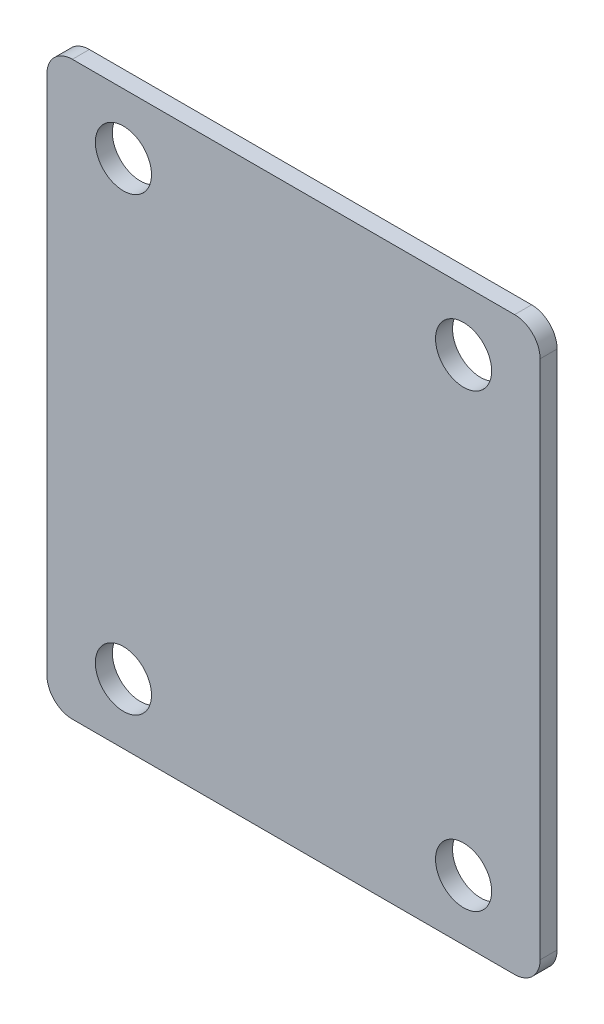
ISO-10303-21;
HEADER;
FILE_DESCRIPTION(('STEP AP214'),'2;1');
FILE_NAME('part.step','',(''),(''),'','','');
FILE_SCHEMA(('AUTOMOTIVE_DESIGN { 1 0 10303 214 1 1 1 1 }'));
ENDSEC;
DATA;
#1=APPLICATION_CONTEXT('core data for automotive mechanical design processes');
#2=APPLICATION_PROTOCOL_DEFINITION('international standard','automotive_design',2000,#1);
#3=PRODUCT_CONTEXT('',#1,'mechanical');
#4=PRODUCT('Part','Part','',(#3));
#5=PRODUCT_RELATED_PRODUCT_CATEGORY('part','',(#4));
#6=PRODUCT_DEFINITION_FORMATION('','',#4);
#7=PRODUCT_DEFINITION_CONTEXT('part definition',#1,'design');
#8=PRODUCT_DEFINITION('design','',#6,#7);
#9=PRODUCT_DEFINITION_SHAPE('','',#8);
#10=(LENGTH_UNIT() NAMED_UNIT(*) SI_UNIT(.MILLI.,.METRE.));
#11=(NAMED_UNIT(*) PLANE_ANGLE_UNIT() SI_UNIT($,.RADIAN.));
#12=(NAMED_UNIT(*) SI_UNIT($,.STERADIAN.) SOLID_ANGLE_UNIT());
#13=UNCERTAINTY_MEASURE_WITH_UNIT(LENGTH_MEASURE(1.E-05),#10,'distance_accuracy_value','');
#14=(GEOMETRIC_REPRESENTATION_CONTEXT(3) GLOBAL_UNCERTAINTY_ASSIGNED_CONTEXT((#13)) GLOBAL_UNIT_ASSIGNED_CONTEXT((#10,
#11,#12)) REPRESENTATION_CONTEXT('',''));
#15=CARTESIAN_POINT('',(0.,0.,0.));
#16=DIRECTION('',(0.,0.,1.));
#17=DIRECTION('',(1.,0.,0.));
#18=AXIS2_PLACEMENT_3D('',#15,#16,#17);
#19=CARTESIAN_POINT('',(0.,0.,2.));
#20=DIRECTION('',(0.,0.,1.));
#21=DIRECTION('',(1.,0.,0.));
#22=AXIS2_PLACEMENT_3D('',#19,#20,#21);
#23=PLANE('',#22);
#24=CARTESIAN_POINT('',(19.9999999999749,-26.5000000000065,2.));
#25=DIRECTION('',(0.,0.,1.));
#26=DIRECTION('',(1.,0.,0.));
#27=AXIS2_PLACEMENT_3D('',#24,#25,#26);
#28=CIRCLE('',#27,3.3);
#29=CARTESIAN_POINT('',(23.2999999999749,-26.5000000000065,2.));
#30=VERTEX_POINT('',#29);
#31=EDGE_CURVE('E155',#30,#30,#28,.T.);
#32=ORIENTED_EDGE('',*,*,#31,.F.);
#33=EDGE_LOOP('',(#32));
#34=FACE_BOUND('',#33,.T.);
#35=CARTESIAN_POINT('',(-20.0000000000251,-26.5000000000064,2.));
#36=DIRECTION('',(0.,0.,1.));
#37=DIRECTION('',(1.,0.,0.));
#38=AXIS2_PLACEMENT_3D('',#35,#36,#37);
#39=CIRCLE('',#38,3.3);
#40=CARTESIAN_POINT('',(-16.7000000000251,-26.5000000000064,2.));
#41=VERTEX_POINT('',#40);
#42=EDGE_CURVE('E170',#41,#41,#39,.T.);
#43=ORIENTED_EDGE('',*,*,#42,.F.);
#44=EDGE_LOOP('',(#43));
#45=FACE_BOUND('',#44,.T.);
#46=CARTESIAN_POINT('',(-20.0000000000249,26.4999999999936,2.));
#47=DIRECTION('',(0.,0.,1.));
#48=DIRECTION('',(1.,0.,0.));
#49=AXIS2_PLACEMENT_3D('',#46,#47,#48);
#50=CIRCLE('',#49,3.3);
#51=CARTESIAN_POINT('',(-16.7000000000249,26.4999999999936,2.));
#52=VERTEX_POINT('',#51);
#53=EDGE_CURVE('E176',#52,#52,#50,.T.);
#54=ORIENTED_EDGE('',*,*,#53,.F.);
#55=EDGE_LOOP('',(#54));
#56=FACE_BOUND('',#55,.T.);
#57=CARTESIAN_POINT('',(19.9999999999751,26.4999999999935,2.));
#58=DIRECTION('',(0.,0.,1.));
#59=DIRECTION('',(1.,0.,0.));
#60=AXIS2_PLACEMENT_3D('',#57,#58,#59);
#61=CIRCLE('',#60,3.3);
#62=CARTESIAN_POINT('',(23.2999999999751,26.4999999999935,2.));
#63=VERTEX_POINT('',#62);
#64=EDGE_CURVE('E42',#63,#63,#61,.T.);
#65=ORIENTED_EDGE('',*,*,#64,.F.);
#66=EDGE_LOOP('',(#65));
#67=FACE_BOUND('',#66,.T.);
#68=CARTESIAN_POINT('',(-26.0000000000066,-30.6000000000016,2.));
#69=DIRECTION('',(0.,0.,1.));
#70=DIRECTION('',(1.,0.,0.));
#71=AXIS2_PLACEMENT_3D('',#68,#69,#70);
#72=CIRCLE('',#71,3.);
#73=CARTESIAN_POINT('',(-29.0000000000066,-30.6000000000016,2.));
#74=VERTEX_POINT('',#73);
#75=CARTESIAN_POINT('',(-26.0000000000066,-33.6000000000016,2.));
#76=VERTEX_POINT('',#75);
#77=EDGE_CURVE('E132',#74,#76,#72,.T.);
#78=ORIENTED_EDGE('',*,*,#77,.T.);
#79=DIRECTION('',(1.,0.,0.));
#80=VECTOR('',#79,1.);
#81=CARTESIAN_POINT('',(-26.0000000000066,-33.6000000000016,2.));
#82=LINE('',#81,#80);
#83=CARTESIAN_POINT('',(25.9999999999932,-33.6000000000016,2.));
#84=VERTEX_POINT('',#83);
#85=EDGE_CURVE('E135',#76,#84,#82,.T.);
#86=ORIENTED_EDGE('',*,*,#85,.T.);
#87=CARTESIAN_POINT('',(25.9999999999933,-30.6000000000016,2.));
#88=DIRECTION('',(0.,0.,1.));
#89=DIRECTION('',(1.,0.,0.));
#90=AXIS2_PLACEMENT_3D('',#87,#88,#89);
#91=CIRCLE('',#90,3.);
#92=CARTESIAN_POINT('',(28.9999999999933,-30.6000000000016,2.));
#93=VERTEX_POINT('',#92);
#94=EDGE_CURVE('E138',#84,#93,#91,.T.);
#95=ORIENTED_EDGE('',*,*,#94,.T.);
#96=DIRECTION('',(0.,1.,0.));
#97=VECTOR('',#96,1.);
#98=CARTESIAN_POINT('',(28.9999999999932,30.5999999999985,2.));
#99=LINE('',#98,#97);
#100=CARTESIAN_POINT('',(28.9999999999932,30.5999999999985,2.));
#101=VERTEX_POINT('',#100);
#102=EDGE_CURVE('E141',#93,#101,#99,.T.);
#103=ORIENTED_EDGE('',*,*,#102,.T.);
#104=CARTESIAN_POINT('',(25.9999999999932,30.5999999999985,2.));
#105=DIRECTION('',(0.,0.,1.));
#106=DIRECTION('',(-1.,0.,0.));
#107=AXIS2_PLACEMENT_3D('',#104,#105,#106);
#108=CIRCLE('',#107,3.);
#109=CARTESIAN_POINT('',(25.9999999999932,33.5999999999985,2.));
#110=VERTEX_POINT('',#109);
#111=EDGE_CURVE('E144',#101,#110,#108,.T.);
#112=ORIENTED_EDGE('',*,*,#111,.T.);
#113=DIRECTION('',(-1.,0.,0.));
#114=VECTOR('',#113,1.);
#115=CARTESIAN_POINT('',(-26.0000000000066,33.5999999999985,2.));
#116=LINE('',#115,#114);
#117=CARTESIAN_POINT('',(-26.0000000000066,33.5999999999985,2.));
#118=VERTEX_POINT('',#117);
#119=EDGE_CURVE('E147',#110,#118,#116,.T.);
#120=ORIENTED_EDGE('',*,*,#119,.T.);
#121=CARTESIAN_POINT('',(-26.0000000000066,30.5999999999985,2.));
#122=DIRECTION('',(0.,0.,1.));
#123=DIRECTION('',(1.,0.,0.));
#124=AXIS2_PLACEMENT_3D('',#121,#122,#123);
#125=CIRCLE('',#124,3.);
#126=CARTESIAN_POINT('',(-29.0000000000066,30.5999999999985,2.));
#127=VERTEX_POINT('',#126);
#128=EDGE_CURVE('E110',#118,#127,#125,.T.);
#129=ORIENTED_EDGE('',*,*,#128,.T.);
#130=DIRECTION('',(0.,-1.,0.));
#131=VECTOR('',#130,1.);
#132=CARTESIAN_POINT('',(-29.0000000000066,30.5999999999985,2.));
#133=LINE('',#132,#131);
#134=EDGE_CURVE('E150',#127,#74,#133,.T.);
#135=ORIENTED_EDGE('',*,*,#134,.T.);
#136=EDGE_LOOP('',(#78,#86,#95,#103,#112,#120,#129,#135));
#137=FACE_BOUND('',#136,.T.);
#138=ADVANCED_FACE('F33',(#34,#45,#56,#67,#137),#23,.T.);
#139=CARTESIAN_POINT('',(0.,0.,0.));
#140=DIRECTION('',(0.,0.,1.));
#141=DIRECTION('',(1.,0.,0.));
#142=AXIS2_PLACEMENT_3D('',#139,#140,#141);
#143=PLANE('',#142);
#144=CARTESIAN_POINT('',(19.9999999999749,-26.5000000000065,0.));
#145=DIRECTION('',(0.,0.,1.));
#146=DIRECTION('',(1.,0.,0.));
#147=AXIS2_PLACEMENT_3D('',#144,#145,#146);
#148=CIRCLE('',#147,3.3);
#149=CARTESIAN_POINT('',(23.2999999999749,-26.5000000000065,0.));
#150=VERTEX_POINT('',#149);
#151=EDGE_CURVE('E167',#150,#150,#148,.T.);
#152=ORIENTED_EDGE('',*,*,#151,.T.);
#153=EDGE_LOOP('',(#152));
#154=FACE_BOUND('',#153,.T.);
#155=CARTESIAN_POINT('',(-20.0000000000251,-26.5000000000064,0.));
#156=DIRECTION('',(0.,0.,1.));
#157=DIRECTION('',(1.,0.,0.));
#158=AXIS2_PLACEMENT_3D('',#155,#156,#157);
#159=CIRCLE('',#158,3.3);
#160=CARTESIAN_POINT('',(-16.7000000000251,-26.5000000000064,0.));
#161=VERTEX_POINT('',#160);
#162=EDGE_CURVE('E173',#161,#161,#159,.T.);
#163=ORIENTED_EDGE('',*,*,#162,.T.);
#164=EDGE_LOOP('',(#163));
#165=FACE_BOUND('',#164,.T.);
#166=CARTESIAN_POINT('',(-20.0000000000249,26.4999999999936,0.));
#167=DIRECTION('',(0.,0.,1.));
#168=DIRECTION('',(1.,0.,0.));
#169=AXIS2_PLACEMENT_3D('',#166,#167,#168);
#170=CIRCLE('',#169,3.3);
#171=CARTESIAN_POINT('',(-16.7000000000249,26.4999999999936,0.));
#172=VERTEX_POINT('',#171);
#173=EDGE_CURVE('E179',#172,#172,#170,.T.);
#174=ORIENTED_EDGE('',*,*,#173,.T.);
#175=EDGE_LOOP('',(#174));
#176=FACE_BOUND('',#175,.T.);
#177=CARTESIAN_POINT('',(19.9999999999751,26.4999999999935,0.));
#178=DIRECTION('',(0.,0.,1.));
#179=DIRECTION('',(1.,0.,0.));
#180=AXIS2_PLACEMENT_3D('',#177,#178,#179);
#181=CIRCLE('',#180,3.3);
#182=CARTESIAN_POINT('',(23.2999999999751,26.4999999999935,0.));
#183=VERTEX_POINT('',#182);
#184=EDGE_CURVE('E11',#183,#183,#181,.T.);
#185=ORIENTED_EDGE('',*,*,#184,.T.);
#186=EDGE_LOOP('',(#185));
#187=FACE_BOUND('',#186,.T.);
#188=CARTESIAN_POINT('',(-26.0000000000066,-30.6000000000016,0.));
#189=DIRECTION('',(0.,0.,1.));
#190=DIRECTION('',(1.,0.,0.));
#191=AXIS2_PLACEMENT_3D('',#188,#189,#190);
#192=CIRCLE('',#191,3.);
#193=CARTESIAN_POINT('',(-29.0000000000066,-30.6000000000016,0.));
#194=VERTEX_POINT('',#193);
#195=CARTESIAN_POINT('',(-26.0000000000066,-33.6000000000016,0.));
#196=VERTEX_POINT('',#195);
#197=EDGE_CURVE('E153',#194,#196,#192,.T.);
#198=ORIENTED_EDGE('',*,*,#197,.F.);
#199=DIRECTION('',(0.,-1.,0.));
#200=VECTOR('',#199,1.);
#201=CARTESIAN_POINT('',(-29.0000000000066,30.5999999999985,0.));
#202=LINE('',#201,#200);
#203=CARTESIAN_POINT('',(-29.0000000000066,30.5999999999985,0.));
#204=VERTEX_POINT('',#203);
#205=EDGE_CURVE('E122',#204,#194,#202,.T.);
#206=ORIENTED_EDGE('',*,*,#205,.F.);
#207=CARTESIAN_POINT('',(-26.0000000000066,30.5999999999985,0.));
#208=DIRECTION('',(0.,0.,1.));
#209=DIRECTION('',(1.,0.,0.));
#210=AXIS2_PLACEMENT_3D('',#207,#208,#209);
#211=CIRCLE('',#210,3.);
#212=CARTESIAN_POINT('',(-26.0000000000066,33.5999999999985,0.));
#213=VERTEX_POINT('',#212);
#214=EDGE_CURVE('E108',#213,#204,#211,.T.);
#215=ORIENTED_EDGE('',*,*,#214,.F.);
#216=DIRECTION('',(-1.,0.,0.));
#217=VECTOR('',#216,1.);
#218=CARTESIAN_POINT('',(-26.0000000000066,33.5999999999985,0.));
#219=LINE('',#218,#217);
#220=CARTESIAN_POINT('',(25.9999999999932,33.5999999999985,0.));
#221=VERTEX_POINT('',#220);
#222=EDGE_CURVE('E120',#221,#213,#219,.T.);
#223=ORIENTED_EDGE('',*,*,#222,.F.);
#224=CARTESIAN_POINT('',(25.9999999999932,30.5999999999985,0.));
#225=DIRECTION('',(0.,0.,1.));
#226=DIRECTION('',(-1.,0.,0.));
#227=AXIS2_PLACEMENT_3D('',#224,#225,#226);
#228=CIRCLE('',#227,3.);
#229=CARTESIAN_POINT('',(28.9999999999932,30.5999999999985,0.));
#230=VERTEX_POINT('',#229);
#231=EDGE_CURVE('E125',#230,#221,#228,.T.);
#232=ORIENTED_EDGE('',*,*,#231,.F.);
#233=DIRECTION('',(0.,1.,0.));
#234=VECTOR('',#233,1.);
#235=CARTESIAN_POINT('',(28.9999999999932,30.5999999999985,0.));
#236=LINE('',#235,#234);
#237=CARTESIAN_POINT('',(28.9999999999933,-30.6000000000016,0.));
#238=VERTEX_POINT('',#237);
#239=EDGE_CURVE('E127',#238,#230,#236,.T.);
#240=ORIENTED_EDGE('',*,*,#239,.F.);
#241=CARTESIAN_POINT('',(25.9999999999933,-30.6000000000016,0.));
#242=DIRECTION('',(0.,0.,1.));
#243=DIRECTION('',(1.,0.,0.));
#244=AXIS2_PLACEMENT_3D('',#241,#242,#243);
#245=CIRCLE('',#244,3.);
#246=CARTESIAN_POINT('',(25.9999999999932,-33.6000000000016,0.));
#247=VERTEX_POINT('',#246);
#248=EDGE_CURVE('E344',#247,#238,#245,.T.);
#249=ORIENTED_EDGE('',*,*,#248,.F.);
#250=DIRECTION('',(1.,0.,0.));
#251=VECTOR('',#250,1.);
#252=CARTESIAN_POINT('',(-26.0000000000066,-33.6000000000016,0.));
#253=LINE('',#252,#251);
#254=EDGE_CURVE('E192',#196,#247,#253,.T.);
#255=ORIENTED_EDGE('',*,*,#254,.F.);
#256=EDGE_LOOP('',(#198,#206,#215,#223,#232,#240,#249,#255));
#257=FACE_BOUND('',#256,.T.);
#258=ADVANCED_FACE('F35',(#154,#165,#176,#187,#257),#143,.F.);
#259=CARTESIAN_POINT('',(19.9999999999751,26.4999999999935,2.));
#260=DIRECTION('',(0.,0.,1.));
#261=DIRECTION('',(1.,0.,0.));
#262=AXIS2_PLACEMENT_3D('',#259,#260,#261);
#263=CYLINDRICAL_SURFACE('',#262,3.3);
#264=ORIENTED_EDGE('',*,*,#184,.F.);
#265=EDGE_LOOP('',(#264));
#266=FACE_BOUND('',#265,.T.);
#267=ORIENTED_EDGE('',*,*,#64,.T.);
#268=EDGE_LOOP('',(#267));
#269=FACE_BOUND('',#268,.T.);
#270=ADVANCED_FACE('F184',(#266,#269),#263,.F.);
#271=CARTESIAN_POINT('',(-20.0000000000249,26.4999999999936,2.));
#272=DIRECTION('',(0.,0.,1.));
#273=DIRECTION('',(1.,0.,0.));
#274=AXIS2_PLACEMENT_3D('',#271,#272,#273);
#275=CYLINDRICAL_SURFACE('',#274,3.3);
#276=ORIENTED_EDGE('',*,*,#173,.F.);
#277=EDGE_LOOP('',(#276));
#278=FACE_BOUND('',#277,.T.);
#279=ORIENTED_EDGE('',*,*,#53,.T.);
#280=EDGE_LOOP('',(#279));
#281=FACE_BOUND('',#280,.T.);
#282=ADVANCED_FACE('F232',(#278,#281),#275,.F.);
#283=CARTESIAN_POINT('',(-20.0000000000251,-26.5000000000064,2.));
#284=DIRECTION('',(0.,0.,1.));
#285=DIRECTION('',(1.,0.,0.));
#286=AXIS2_PLACEMENT_3D('',#283,#284,#285);
#287=CYLINDRICAL_SURFACE('',#286,3.3);
#288=ORIENTED_EDGE('',*,*,#162,.F.);
#289=EDGE_LOOP('',(#288));
#290=FACE_BOUND('',#289,.T.);
#291=ORIENTED_EDGE('',*,*,#42,.T.);
#292=EDGE_LOOP('',(#291));
#293=FACE_BOUND('',#292,.T.);
#294=ADVANCED_FACE('F228',(#290,#293),#287,.F.);
#295=CARTESIAN_POINT('',(19.9999999999749,-26.5000000000065,2.));
#296=DIRECTION('',(0.,0.,1.));
#297=DIRECTION('',(1.,0.,0.));
#298=AXIS2_PLACEMENT_3D('',#295,#296,#297);
#299=CYLINDRICAL_SURFACE('',#298,3.3);
#300=ORIENTED_EDGE('',*,*,#151,.F.);
#301=EDGE_LOOP('',(#300));
#302=FACE_BOUND('',#301,.T.);
#303=ORIENTED_EDGE('',*,*,#31,.T.);
#304=EDGE_LOOP('',(#303));
#305=FACE_BOUND('',#304,.T.);
#306=ADVANCED_FACE('F213',(#302,#305),#299,.F.);
#307=CARTESIAN_POINT('',(-26.0000000000066,-30.6000000000016,0.));
#308=DIRECTION('',(0.,0.,1.));
#309=DIRECTION('',(1.,0.,0.));
#310=AXIS2_PLACEMENT_3D('',#307,#308,#309);
#311=CYLINDRICAL_SURFACE('',#310,3.);
#312=ORIENTED_EDGE('',*,*,#77,.F.);
#313=DIRECTION('',(0.,0.,1.));
#314=VECTOR('',#313,1.);
#315=CARTESIAN_POINT('',(-29.0000000000066,-30.6000000000016,0.));
#316=LINE('',#315,#314);
#317=EDGE_CURVE('E50',#194,#74,#316,.T.);
#318=ORIENTED_EDGE('',*,*,#317,.F.);
#319=ORIENTED_EDGE('',*,*,#197,.T.);
#320=DIRECTION('',(0.,0.,1.));
#321=VECTOR('',#320,1.);
#322=CARTESIAN_POINT('',(-26.0000000000066,-33.6000000000016,0.));
#323=LINE('',#322,#321);
#324=EDGE_CURVE('E91',#196,#76,#323,.T.);
#325=ORIENTED_EDGE('',*,*,#324,.T.);
#326=EDGE_LOOP('',(#312,#318,#319,#325));
#327=FACE_BOUND('',#326,.T.);
#328=ADVANCED_FACE('F189',(#327),#311,.T.);
#329=CARTESIAN_POINT('',(-29.0000000000066,30.5999999999985,0.));
#330=DIRECTION('',(-1.,0.,0.));
#331=DIRECTION('',(0.,-1.,0.));
#332=AXIS2_PLACEMENT_3D('',#329,#330,#331);
#333=PLANE('',#332);
#334=ORIENTED_EDGE('',*,*,#134,.F.);
#335=DIRECTION('',(0.,0.,1.));
#336=VECTOR('',#335,1.);
#337=CARTESIAN_POINT('',(-29.0000000000066,30.5999999999985,0.));
#338=LINE('',#337,#336);
#339=EDGE_CURVE('E79',#204,#127,#338,.T.);
#340=ORIENTED_EDGE('',*,*,#339,.F.);
#341=ORIENTED_EDGE('',*,*,#205,.T.);
#342=ORIENTED_EDGE('',*,*,#317,.T.);
#343=EDGE_LOOP('',(#334,#340,#341,#342));
#344=FACE_BOUND('',#343,.T.);
#345=ADVANCED_FACE('F205',(#344),#333,.T.);
#346=CARTESIAN_POINT('',(-26.0000000000066,30.5999999999985,0.));
#347=DIRECTION('',(0.,0.,1.));
#348=DIRECTION('',(1.,0.,0.));
#349=AXIS2_PLACEMENT_3D('',#346,#347,#348);
#350=CYLINDRICAL_SURFACE('',#349,3.);
#351=ORIENTED_EDGE('',*,*,#128,.F.);
#352=DIRECTION('',(0.,0.,1.));
#353=VECTOR('',#352,1.);
#354=CARTESIAN_POINT('',(-26.0000000000066,33.5999999999985,0.));
#355=LINE('',#354,#353);
#356=EDGE_CURVE('E105',#213,#118,#355,.T.);
#357=ORIENTED_EDGE('',*,*,#356,.F.);
#358=ORIENTED_EDGE('',*,*,#214,.T.);
#359=ORIENTED_EDGE('',*,*,#339,.T.);
#360=EDGE_LOOP('',(#351,#357,#358,#359));
#361=FACE_BOUND('',#360,.T.);
#362=ADVANCED_FACE('F107',(#361),#350,.T.);
#363=CARTESIAN_POINT('',(-26.0000000000066,33.5999999999985,0.));
#364=DIRECTION('',(0.,1.,0.));
#365=DIRECTION('',(0.,0.,1.));
#366=AXIS2_PLACEMENT_3D('',#363,#364,#365);
#367=PLANE('',#366);
#368=ORIENTED_EDGE('',*,*,#119,.F.);
#369=DIRECTION('',(0.,0.,1.));
#370=VECTOR('',#369,1.);
#371=CARTESIAN_POINT('',(25.9999999999932,33.5999999999985,0.));
#372=LINE('',#371,#370);
#373=EDGE_CURVE('E115',#221,#110,#372,.T.);
#374=ORIENTED_EDGE('',*,*,#373,.F.);
#375=ORIENTED_EDGE('',*,*,#222,.T.);
#376=ORIENTED_EDGE('',*,*,#356,.T.);
#377=EDGE_LOOP('',(#368,#374,#375,#376));
#378=FACE_BOUND('',#377,.T.);
#379=ADVANCED_FACE('F124',(#378),#367,.T.);
#380=CARTESIAN_POINT('',(25.9999999999932,30.5999999999985,0.));
#381=DIRECTION('',(0.,0.,1.));
#382=DIRECTION('',(1.,0.,0.));
#383=AXIS2_PLACEMENT_3D('',#380,#381,#382);
#384=CYLINDRICAL_SURFACE('',#383,3.);
#385=ORIENTED_EDGE('',*,*,#111,.F.);
#386=DIRECTION('',(0.,0.,1.));
#387=VECTOR('',#386,1.);
#388=CARTESIAN_POINT('',(28.9999999999932,30.5999999999985,0.));
#389=LINE('',#388,#387);
#390=EDGE_CURVE('E158',#230,#101,#389,.T.);
#391=ORIENTED_EDGE('',*,*,#390,.F.);
#392=ORIENTED_EDGE('',*,*,#231,.T.);
#393=ORIENTED_EDGE('',*,*,#373,.T.);
#394=EDGE_LOOP('',(#385,#391,#392,#393));
#395=FACE_BOUND('',#394,.T.);
#396=ADVANCED_FACE('F204',(#395),#384,.T.);
#397=CARTESIAN_POINT('',(28.9999999999932,30.5999999999985,0.));
#398=DIRECTION('',(1.,0.,0.));
#399=DIRECTION('',(0.,1.,0.));
#400=AXIS2_PLACEMENT_3D('',#397,#398,#399);
#401=PLANE('',#400);
#402=ORIENTED_EDGE('',*,*,#102,.F.);
#403=DIRECTION('',(0.,0.,1.));
#404=VECTOR('',#403,1.);
#405=CARTESIAN_POINT('',(28.9999999999933,-30.6000000000016,0.));
#406=LINE('',#405,#404);
#407=EDGE_CURVE('E160',#238,#93,#406,.T.);
#408=ORIENTED_EDGE('',*,*,#407,.F.);
#409=ORIENTED_EDGE('',*,*,#239,.T.);
#410=ORIENTED_EDGE('',*,*,#390,.T.);
#411=EDGE_LOOP('',(#402,#408,#409,#410));
#412=FACE_BOUND('',#411,.T.);
#413=ADVANCED_FACE('F200',(#412),#401,.T.);
#414=CARTESIAN_POINT('',(25.9999999999933,-30.6000000000016,0.));
#415=DIRECTION('',(0.,0.,1.));
#416=DIRECTION('',(1.,0.,0.));
#417=AXIS2_PLACEMENT_3D('',#414,#415,#416);
#418=CYLINDRICAL_SURFACE('',#417,3.);
#419=ORIENTED_EDGE('',*,*,#94,.F.);
#420=DIRECTION('',(0.,0.,1.));
#421=VECTOR('',#420,1.);
#422=CARTESIAN_POINT('',(25.9999999999932,-33.6000000000016,0.));
#423=LINE('',#422,#421);
#424=EDGE_CURVE('E162',#247,#84,#423,.T.);
#425=ORIENTED_EDGE('',*,*,#424,.F.);
#426=ORIENTED_EDGE('',*,*,#248,.T.);
#427=ORIENTED_EDGE('',*,*,#407,.T.);
#428=EDGE_LOOP('',(#419,#425,#426,#427));
#429=FACE_BOUND('',#428,.T.);
#430=ADVANCED_FACE('F196',(#429),#418,.T.);
#431=CARTESIAN_POINT('',(-26.0000000000066,-33.6000000000016,0.));
#432=DIRECTION('',(0.,-1.,0.));
#433=DIRECTION('',(0.,0.,-1.));
#434=AXIS2_PLACEMENT_3D('',#431,#432,#433);
#435=PLANE('',#434);
#436=ORIENTED_EDGE('',*,*,#85,.F.);
#437=ORIENTED_EDGE('',*,*,#324,.F.);
#438=ORIENTED_EDGE('',*,*,#254,.T.);
#439=ORIENTED_EDGE('',*,*,#424,.T.);
#440=EDGE_LOOP('',(#436,#437,#438,#439));
#441=FACE_BOUND('',#440,.T.);
#442=ADVANCED_FACE('F190',(#441),#435,.T.);
#443=CLOSED_SHELL('',(#138,#258,#270,#282,#294,#306,#328,#345,#362,#379,#396,#413,#430,#442));
#444=MANIFOLD_SOLID_BREP('B2',#443);
#445=ADVANCED_BREP_SHAPE_REPRESENTATION('',(#18,#444),#14);
#446=SHAPE_DEFINITION_REPRESENTATION(#9,#445);
ENDSEC;
END-ISO-10303-21;
